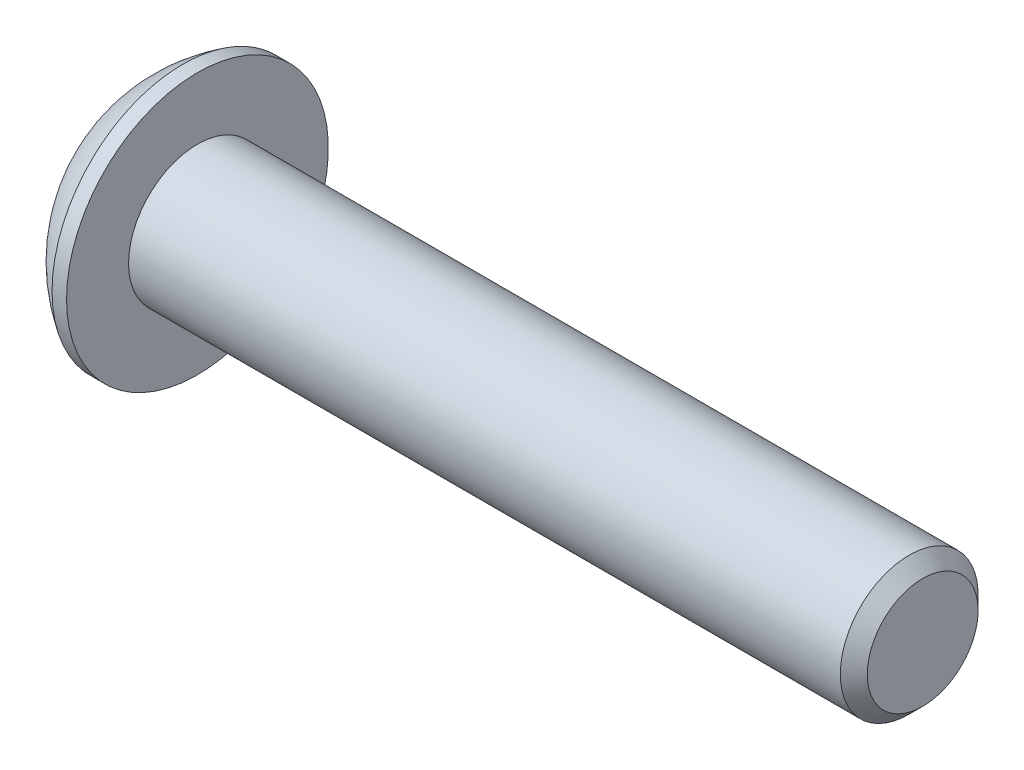
ISO-10303-21;
HEADER;
FILE_DESCRIPTION(('STEP AP214'),'2;1');
FILE_NAME('part.step','',(''),(''),'','','');
FILE_SCHEMA(('AUTOMOTIVE_DESIGN { 1 0 10303 214 1 1 1 1 }'));
ENDSEC;
DATA;
#1=APPLICATION_CONTEXT('core data for automotive mechanical design processes');
#2=APPLICATION_PROTOCOL_DEFINITION('international standard','automotive_design',2000,#1);
#3=PRODUCT_CONTEXT('',#1,'mechanical');
#4=PRODUCT('Part','Part','',(#3));
#5=PRODUCT_RELATED_PRODUCT_CATEGORY('part','',(#4));
#6=PRODUCT_DEFINITION_FORMATION('','',#4);
#7=PRODUCT_DEFINITION_CONTEXT('part definition',#1,'design');
#8=PRODUCT_DEFINITION('design','',#6,#7);
#9=PRODUCT_DEFINITION_SHAPE('','',#8);
#10=(LENGTH_UNIT() NAMED_UNIT(*) SI_UNIT(.MILLI.,.METRE.));
#11=(NAMED_UNIT(*) PLANE_ANGLE_UNIT() SI_UNIT($,.RADIAN.));
#12=(NAMED_UNIT(*) SI_UNIT($,.STERADIAN.) SOLID_ANGLE_UNIT());
#13=UNCERTAINTY_MEASURE_WITH_UNIT(LENGTH_MEASURE(1.E-05),#10,'distance_accuracy_value','');
#14=(GEOMETRIC_REPRESENTATION_CONTEXT(3) GLOBAL_UNCERTAINTY_ASSIGNED_CONTEXT((#13)) GLOBAL_UNIT_ASSIGNED_CONTEXT((#10,
#11,#12)) REPRESENTATION_CONTEXT('',''));
#15=CARTESIAN_POINT('',(0.,0.,0.));
#16=DIRECTION('',(0.,0.,1.));
#17=DIRECTION('',(1.,0.,0.));
#18=AXIS2_PLACEMENT_3D('',#15,#16,#17);
#19=CARTESIAN_POINT('',(1.77800000000006,0.,0.));
#20=DIRECTION('',(-1.,0.,0.));
#21=DIRECTION('',(0.,0.,1.));
#22=AXIS2_PLACEMENT_3D('',#19,#20,#21);
#23=CONICAL_SURFACE('',#22,1.58750000000007,1.04719755119647);
#24=CARTESIAN_POINT('',(2.69454355233878,0.,0.));
#25=VERTEX_POINT('',#24);
#26=VERTEX_LOOP('',#25);
#27=FACE_BOUND('',#26,.T.);
#28=CARTESIAN_POINT('',(1.77800000000006,0.,0.));
#29=DIRECTION('',(-1.,0.,0.));
#30=DIRECTION('',(0.,0.,1.));
#31=AXIS2_PLACEMENT_3D('',#28,#29,#30);
#32=CIRCLE('',#31,1.58750000000007);
#33=CARTESIAN_POINT('',(1.77800000000003,0.,1.58750000000004));
#34=VERTEX_POINT('',#33);
#35=CARTESIAN_POINT('',(1.77800000000003,-1.37481532850783,0.793750000000017));
#36=VERTEX_POINT('',#35);
#37=EDGE_CURVE('E20',#34,#36,#32,.F.);
#38=ORIENTED_EDGE('',*,*,#37,.F.);
#39=CARTESIAN_POINT('',(1.77800000000006,0.,0.));
#40=DIRECTION('',(-1.,0.,0.));
#41=DIRECTION('',(0.,0.,1.));
#42=AXIS2_PLACEMENT_3D('',#39,#40,#41);
#43=CIRCLE('',#42,1.58750000000007);
#44=CARTESIAN_POINT('',(1.77800000000003,1.37481532850783,0.793750000000019));
#45=VERTEX_POINT('',#44);
#46=EDGE_CURVE('E90',#34,#45,#43,.T.);
#47=ORIENTED_EDGE('',*,*,#46,.T.);
#48=CARTESIAN_POINT('',(1.77800000000006,0.,0.));
#49=DIRECTION('',(-1.,0.,0.));
#50=DIRECTION('',(0.,0.,1.));
#51=AXIS2_PLACEMENT_3D('',#48,#49,#50);
#52=CIRCLE('',#51,1.58750000000007);
#53=CARTESIAN_POINT('',(1.77800000000003,1.37481532850783,-0.793750000000019));
#54=VERTEX_POINT('',#53);
#55=EDGE_CURVE('E106',#45,#54,#52,.T.);
#56=ORIENTED_EDGE('',*,*,#55,.T.);
#57=CARTESIAN_POINT('',(1.77800000000006,0.,0.));
#58=DIRECTION('',(-1.,0.,0.));
#59=DIRECTION('',(0.,0.,1.));
#60=AXIS2_PLACEMENT_3D('',#57,#58,#59);
#61=CIRCLE('',#60,1.58750000000007);
#62=CARTESIAN_POINT('',(1.77800000000003,-2.78602967841758E-12,-1.58750000000004));
#63=VERTEX_POINT('',#62);
#64=EDGE_CURVE('E473',#54,#63,#61,.T.);
#65=ORIENTED_EDGE('',*,*,#64,.T.);
#66=CARTESIAN_POINT('',(1.77800000000006,0.,0.));
#67=DIRECTION('',(-1.,0.,0.));
#68=DIRECTION('',(0.,0.,1.));
#69=AXIS2_PLACEMENT_3D('',#66,#67,#68);
#70=CIRCLE('',#69,1.58750000000007);
#71=CARTESIAN_POINT('',(1.77800000000003,-1.37481532850783,-0.793750000000017));
#72=VERTEX_POINT('',#71);
#73=EDGE_CURVE('E475',#72,#63,#70,.F.);
#74=ORIENTED_EDGE('',*,*,#73,.F.);
#75=CARTESIAN_POINT('',(1.77800000000006,0.,0.));
#76=DIRECTION('',(-1.,0.,0.));
#77=DIRECTION('',(0.,0.,1.));
#78=AXIS2_PLACEMENT_3D('',#75,#76,#77);
#79=CIRCLE('',#78,1.58750000000007);
#80=EDGE_CURVE('E93',#36,#72,#79,.F.);
#81=ORIENTED_EDGE('',*,*,#80,.F.);
#82=EDGE_LOOP('',(#38,#47,#56,#65,#74,#81));
#83=FACE_BOUND('',#82,.T.);
#84=ADVANCED_FACE('F17',(#27,#83),#23,.F.);
#85=CARTESIAN_POINT('',(1.778,-2.74963065701559,-1.5875));
#86=DIRECTION('',(1.,0.,0.));
#87=DIRECTION('',(0.,0.,-1.));
#88=AXIS2_PLACEMENT_3D('',#85,#86,#87);
#89=PLANE('',#88);
#90=DIRECTION('',(0.,0.5,0.866025403784439));
#91=VECTOR('',#90,1.);
#92=CARTESIAN_POINT('',(1.778,-1.83308710467706,0.));
#93=LINE('',#92,#91);
#94=CARTESIAN_POINT('',(1.778,-0.91654355233853,1.5875));
#95=VERTEX_POINT('',#94);
#96=EDGE_CURVE('E111',#95,#36,#93,.F.);
#97=ORIENTED_EDGE('',*,*,#96,.F.);
#98=DIRECTION('',(0.,1.,0.));
#99=VECTOR('',#98,1.);
#100=CARTESIAN_POINT('',(1.778,-0.91654355233853,1.5875));
#101=LINE('',#100,#99);
#102=EDGE_CURVE('E109',#34,#95,#101,.F.);
#103=ORIENTED_EDGE('',*,*,#102,.F.);
#104=ORIENTED_EDGE('',*,*,#37,.T.);
#105=EDGE_LOOP('',(#97,#103,#104));
#106=FACE_BOUND('',#105,.T.);
#107=ADVANCED_FACE('F110',(#106),#89,.F.);
#108=CARTESIAN_POINT('',(1.778,-2.74963065701559,-1.5875));
#109=DIRECTION('',(1.,0.,0.));
#110=DIRECTION('',(0.,0.,-1.));
#111=AXIS2_PLACEMENT_3D('',#108,#109,#110);
#112=PLANE('',#111);
#113=DIRECTION('',(0.,-0.5,0.866025403784439));
#114=VECTOR('',#113,1.);
#115=CARTESIAN_POINT('',(1.778,-0.91654355233853,-1.5875));
#116=LINE('',#115,#114);
#117=CARTESIAN_POINT('',(1.778,-1.83308710467706,0.));
#118=VERTEX_POINT('',#117);
#119=EDGE_CURVE('E159',#118,#72,#116,.F.);
#120=ORIENTED_EDGE('',*,*,#119,.F.);
#121=DIRECTION('',(0.,0.5,0.866025403784439));
#122=VECTOR('',#121,1.);
#123=CARTESIAN_POINT('',(1.778,-1.83308710467706,0.));
#124=LINE('',#123,#122);
#125=EDGE_CURVE('E171',#36,#118,#124,.F.);
#126=ORIENTED_EDGE('',*,*,#125,.F.);
#127=ORIENTED_EDGE('',*,*,#80,.T.);
#128=EDGE_LOOP('',(#120,#126,#127));
#129=FACE_BOUND('',#128,.T.);
#130=ADVANCED_FACE('F248',(#129),#112,.F.);
#131=CARTESIAN_POINT('',(1.778,-2.74963065701559,-1.5875));
#132=DIRECTION('',(1.,0.,0.));
#133=DIRECTION('',(0.,0.,-1.));
#134=AXIS2_PLACEMENT_3D('',#131,#132,#133);
#135=PLANE('',#134);
#136=DIRECTION('',(0.,1.,0.));
#137=VECTOR('',#136,1.);
#138=CARTESIAN_POINT('',(1.778,0.916543552338532,-1.5875));
#139=LINE('',#138,#137);
#140=CARTESIAN_POINT('',(1.778,-0.91654355233853,-1.5875));
#141=VERTEX_POINT('',#140);
#142=EDGE_CURVE('E143',#141,#63,#139,.T.);
#143=ORIENTED_EDGE('',*,*,#142,.F.);
#144=DIRECTION('',(0.,-0.5,0.866025403784439));
#145=VECTOR('',#144,1.);
#146=CARTESIAN_POINT('',(1.778,-0.91654355233853,-1.5875));
#147=LINE('',#146,#145);
#148=EDGE_CURVE('E156',#72,#141,#147,.F.);
#149=ORIENTED_EDGE('',*,*,#148,.F.);
#150=ORIENTED_EDGE('',*,*,#73,.T.);
#151=EDGE_LOOP('',(#143,#149,#150));
#152=FACE_BOUND('',#151,.T.);
#153=ADVANCED_FACE('F244',(#152),#135,.F.);
#154=CARTESIAN_POINT('',(1.778,-2.74963065701559,-1.5875));
#155=DIRECTION('',(1.,0.,0.));
#156=DIRECTION('',(0.,0.,-1.));
#157=AXIS2_PLACEMENT_3D('',#154,#155,#156);
#158=PLANE('',#157);
#159=DIRECTION('',(0.,-0.5,-0.866025403784439));
#160=VECTOR('',#159,1.);
#161=CARTESIAN_POINT('',(1.778,1.83308710467706,0.));
#162=LINE('',#161,#160);
#163=CARTESIAN_POINT('',(1.778,0.916543552338532,-1.5875));
#164=VERTEX_POINT('',#163);
#165=EDGE_CURVE('E128',#164,#54,#162,.F.);
#166=ORIENTED_EDGE('',*,*,#165,.F.);
#167=DIRECTION('',(0.,1.,0.));
#168=VECTOR('',#167,1.);
#169=CARTESIAN_POINT('',(1.778,0.916543552338532,-1.5875));
#170=LINE('',#169,#168);
#171=EDGE_CURVE('E140',#63,#164,#170,.T.);
#172=ORIENTED_EDGE('',*,*,#171,.F.);
#173=ORIENTED_EDGE('',*,*,#64,.F.);
#174=EDGE_LOOP('',(#166,#172,#173));
#175=FACE_BOUND('',#174,.T.);
#176=ADVANCED_FACE('F240',(#175),#158,.F.);
#177=CARTESIAN_POINT('',(1.778,-2.74963065701559,-1.5875));
#178=DIRECTION('',(1.,0.,0.));
#179=DIRECTION('',(0.,0.,-1.));
#180=AXIS2_PLACEMENT_3D('',#177,#178,#179);
#181=PLANE('',#180);
#182=DIRECTION('',(0.,0.5,-0.866025403784439));
#183=VECTOR('',#182,1.);
#184=CARTESIAN_POINT('',(1.778,0.916543552338533,1.5875));
#185=LINE('',#184,#183);
#186=CARTESIAN_POINT('',(1.778,1.83308710467706,0.));
#187=VERTEX_POINT('',#186);
#188=EDGE_CURVE('E148',#187,#45,#185,.F.);
#189=ORIENTED_EDGE('',*,*,#188,.F.);
#190=DIRECTION('',(0.,-0.5,-0.866025403784439));
#191=VECTOR('',#190,1.);
#192=CARTESIAN_POINT('',(1.778,1.83308710467706,0.));
#193=LINE('',#192,#191);
#194=EDGE_CURVE('E125',#54,#187,#193,.F.);
#195=ORIENTED_EDGE('',*,*,#194,.F.);
#196=ORIENTED_EDGE('',*,*,#55,.F.);
#197=EDGE_LOOP('',(#189,#195,#196));
#198=FACE_BOUND('',#197,.T.);
#199=ADVANCED_FACE('F237',(#198),#181,.F.);
#200=CARTESIAN_POINT('',(1.778,-2.74963065701559,-1.5875));
#201=DIRECTION('',(1.,0.,0.));
#202=DIRECTION('',(0.,0.,-1.));
#203=AXIS2_PLACEMENT_3D('',#200,#201,#202);
#204=PLANE('',#203);
#205=DIRECTION('',(0.,1.,0.));
#206=VECTOR('',#205,1.);
#207=CARTESIAN_POINT('',(1.778,-0.91654355233853,1.5875));
#208=LINE('',#207,#206);
#209=CARTESIAN_POINT('',(1.778,0.916543552338533,1.5875));
#210=VERTEX_POINT('',#209);
#211=EDGE_CURVE('E101',#210,#34,#208,.F.);
#212=ORIENTED_EDGE('',*,*,#211,.F.);
#213=DIRECTION('',(0.,0.5,-0.866025403784439));
#214=VECTOR('',#213,1.);
#215=CARTESIAN_POINT('',(1.778,0.916543552338533,1.5875));
#216=LINE('',#215,#214);
#217=EDGE_CURVE('E104',#45,#210,#216,.F.);
#218=ORIENTED_EDGE('',*,*,#217,.F.);
#219=ORIENTED_EDGE('',*,*,#46,.F.);
#220=EDGE_LOOP('',(#212,#218,#219));
#221=FACE_BOUND('',#220,.T.);
#222=ADVANCED_FACE('F99',(#221),#204,.F.);
#223=CARTESIAN_POINT('',(1.778,-0.91654355233853,1.5875));
#224=DIRECTION('',(0.,0.,-1.));
#225=DIRECTION('',(0.,1.,0.));
#226=AXIS2_PLACEMENT_3D('',#223,#224,#225);
#227=PLANE('',#226);
#228=DIRECTION('',(0.,1.,0.));
#229=VECTOR('',#228,1.);
#230=CARTESIAN_POINT('',(0.,0.,1.5875));
#231=LINE('',#230,#229);
#232=CARTESIAN_POINT('',(0.,0.916543552338532,1.5875));
#233=VERTEX_POINT('',#232);
#234=CARTESIAN_POINT('',(0.,-0.91654355233853,1.5875));
#235=VERTEX_POINT('',#234);
#236=EDGE_CURVE('E132',#233,#235,#231,.F.);
#237=ORIENTED_EDGE('',*,*,#236,.F.);
#238=DIRECTION('',(1.,0.,0.));
#239=VECTOR('',#238,1.);
#240=CARTESIAN_POINT('',(1.778,0.916543552338533,1.5875));
#241=LINE('',#240,#239);
#242=EDGE_CURVE('E117',#210,#233,#241,.F.);
#243=ORIENTED_EDGE('',*,*,#242,.F.);
#244=ORIENTED_EDGE('',*,*,#211,.T.);
#245=ORIENTED_EDGE('',*,*,#102,.T.);
#246=DIRECTION('',(1.,0.,0.));
#247=VECTOR('',#246,1.);
#248=CARTESIAN_POINT('',(1.778,-0.91654355233853,1.5875));
#249=LINE('',#248,#247);
#250=EDGE_CURVE('E168',#235,#95,#249,.T.);
#251=ORIENTED_EDGE('',*,*,#250,.F.);
#252=EDGE_LOOP('',(#237,#243,#244,#245,#251));
#253=FACE_BOUND('',#252,.T.);
#254=ADVANCED_FACE('F115',(#253),#227,.T.);
#255=CARTESIAN_POINT('',(1.778,-1.83308710467706,0.));
#256=DIRECTION('',(0.,0.866025403784439,-0.5));
#257=DIRECTION('',(0.,0.5,0.866025403784439));
#258=AXIS2_PLACEMENT_3D('',#255,#256,#257);
#259=PLANE('',#258);
#260=DIRECTION('',(0.,-0.5,-0.866025403784439));
#261=VECTOR('',#260,1.);
#262=CARTESIAN_POINT('',(0.,-0.91654355233853,1.5875));
#263=LINE('',#262,#261);
#264=CARTESIAN_POINT('',(0.,-1.83308710467706,0.));
#265=VERTEX_POINT('',#264);
#266=EDGE_CURVE('E459',#235,#265,#263,.T.);
#267=ORIENTED_EDGE('',*,*,#266,.F.);
#268=ORIENTED_EDGE('',*,*,#250,.T.);
#269=ORIENTED_EDGE('',*,*,#96,.T.);
#270=ORIENTED_EDGE('',*,*,#125,.T.);
#271=DIRECTION('',(1.,0.,0.));
#272=VECTOR('',#271,1.);
#273=CARTESIAN_POINT('',(1.778,-1.83308710467706,0.));
#274=LINE('',#273,#272);
#275=EDGE_CURVE('E153',#265,#118,#274,.T.);
#276=ORIENTED_EDGE('',*,*,#275,.F.);
#277=EDGE_LOOP('',(#267,#268,#269,#270,#276));
#278=FACE_BOUND('',#277,.T.);
#279=ADVANCED_FACE('F228',(#278),#259,.T.);
#280=CARTESIAN_POINT('',(1.778,-0.91654355233853,-1.5875));
#281=DIRECTION('',(0.,0.866025403784439,0.5));
#282=DIRECTION('',(0.,-0.5,0.866025403784439));
#283=AXIS2_PLACEMENT_3D('',#280,#281,#282);
#284=PLANE('',#283);
#285=DIRECTION('',(0.,0.5,-0.866025403784439));
#286=VECTOR('',#285,1.);
#287=CARTESIAN_POINT('',(0.,-1.83308710467706,0.));
#288=LINE('',#287,#286);
#289=CARTESIAN_POINT('',(0.,-0.91654355233853,-1.5875));
#290=VERTEX_POINT('',#289);
#291=EDGE_CURVE('E456',#265,#290,#288,.T.);
#292=ORIENTED_EDGE('',*,*,#291,.F.);
#293=ORIENTED_EDGE('',*,*,#275,.T.);
#294=ORIENTED_EDGE('',*,*,#119,.T.);
#295=ORIENTED_EDGE('',*,*,#148,.T.);
#296=DIRECTION('',(1.,0.,0.));
#297=VECTOR('',#296,1.);
#298=CARTESIAN_POINT('',(1.778,-0.91654355233853,-1.5875));
#299=LINE('',#298,#297);
#300=EDGE_CURVE('E137',#290,#141,#299,.T.);
#301=ORIENTED_EDGE('',*,*,#300,.F.);
#302=EDGE_LOOP('',(#292,#293,#294,#295,#301));
#303=FACE_BOUND('',#302,.T.);
#304=ADVANCED_FACE('F224',(#303),#284,.T.);
#305=CARTESIAN_POINT('',(1.778,0.916543552338532,-1.5875));
#306=DIRECTION('',(0.,0.,1.));
#307=DIRECTION('',(1.,0.,0.));
#308=AXIS2_PLACEMENT_3D('',#305,#306,#307);
#309=PLANE('',#308);
#310=DIRECTION('',(0.,1.,0.));
#311=VECTOR('',#310,1.);
#312=CARTESIAN_POINT('',(0.,0.,-1.5875));
#313=LINE('',#312,#311);
#314=CARTESIAN_POINT('',(0.,0.916543552338532,-1.5875));
#315=VERTEX_POINT('',#314);
#316=EDGE_CURVE('E453',#290,#315,#313,.T.);
#317=ORIENTED_EDGE('',*,*,#316,.F.);
#318=ORIENTED_EDGE('',*,*,#300,.T.);
#319=ORIENTED_EDGE('',*,*,#142,.T.);
#320=ORIENTED_EDGE('',*,*,#171,.T.);
#321=DIRECTION('',(1.,0.,0.));
#322=VECTOR('',#321,1.);
#323=CARTESIAN_POINT('',(1.778,0.916543552338532,-1.5875));
#324=LINE('',#323,#322);
#325=EDGE_CURVE('E127',#315,#164,#324,.T.);
#326=ORIENTED_EDGE('',*,*,#325,.F.);
#327=EDGE_LOOP('',(#317,#318,#319,#320,#326));
#328=FACE_BOUND('',#327,.T.);
#329=ADVANCED_FACE('F221',(#328),#309,.T.);
#330=CARTESIAN_POINT('',(1.778,1.83308710467706,0.));
#331=DIRECTION('',(0.,-0.866025403784439,0.5));
#332=DIRECTION('',(0.,-0.5,-0.866025403784439));
#333=AXIS2_PLACEMENT_3D('',#330,#331,#332);
#334=PLANE('',#333);
#335=DIRECTION('',(0.,0.5,0.866025403784438));
#336=VECTOR('',#335,1.);
#337=CARTESIAN_POINT('',(0.,0.916543552338532,-1.5875));
#338=LINE('',#337,#336);
#339=CARTESIAN_POINT('',(0.,1.83308710467706,0.));
#340=VERTEX_POINT('',#339);
#341=EDGE_CURVE('E450',#315,#340,#338,.T.);
#342=ORIENTED_EDGE('',*,*,#341,.F.);
#343=ORIENTED_EDGE('',*,*,#325,.T.);
#344=ORIENTED_EDGE('',*,*,#165,.T.);
#345=ORIENTED_EDGE('',*,*,#194,.T.);
#346=DIRECTION('',(1.,0.,0.));
#347=VECTOR('',#346,1.);
#348=CARTESIAN_POINT('',(1.778,1.83308710467706,0.));
#349=LINE('',#348,#347);
#350=EDGE_CURVE('E35',#340,#187,#349,.T.);
#351=ORIENTED_EDGE('',*,*,#350,.F.);
#352=EDGE_LOOP('',(#342,#343,#344,#345,#351));
#353=FACE_BOUND('',#352,.T.);
#354=ADVANCED_FACE('F217',(#353),#334,.T.);
#355=CARTESIAN_POINT('',(1.778,0.916543552338533,1.5875));
#356=DIRECTION('',(0.,-0.866025403784439,-0.5));
#357=DIRECTION('',(0.,0.5,-0.866025403784439));
#358=AXIS2_PLACEMENT_3D('',#355,#356,#357);
#359=PLANE('',#358);
#360=DIRECTION('',(0.,-0.5,0.866025403784439));
#361=VECTOR('',#360,1.);
#362=CARTESIAN_POINT('',(0.,1.83308710467706,0.));
#363=LINE('',#362,#361);
#364=EDGE_CURVE('E203',#340,#233,#363,.T.);
#365=ORIENTED_EDGE('',*,*,#364,.F.);
#366=ORIENTED_EDGE('',*,*,#350,.T.);
#367=ORIENTED_EDGE('',*,*,#188,.T.);
#368=ORIENTED_EDGE('',*,*,#217,.T.);
#369=ORIENTED_EDGE('',*,*,#242,.T.);
#370=EDGE_LOOP('',(#365,#366,#367,#368,#369));
#371=FACE_BOUND('',#370,.T.);
#372=ADVANCED_FACE('F213',(#371),#359,.T.);
#373=CARTESIAN_POINT('',(0.,0.,0.));
#374=DIRECTION('',(-1.,0.,0.));
#375=DIRECTION('',(0.,0.,1.));
#376=AXIS2_PLACEMENT_3D('',#373,#374,#375);
#377=PLANE('',#376);
#378=ORIENTED_EDGE('',*,*,#341,.T.);
#379=ORIENTED_EDGE('',*,*,#364,.T.);
#380=ORIENTED_EDGE('',*,*,#236,.T.);
#381=ORIENTED_EDGE('',*,*,#266,.T.);
#382=ORIENTED_EDGE('',*,*,#291,.T.);
#383=ORIENTED_EDGE('',*,*,#316,.T.);
#384=EDGE_LOOP('',(#378,#379,#380,#381,#382,#383));
#385=FACE_BOUND('',#384,.T.);
#386=CARTESIAN_POINT('',(0.,2.29235,0.));
#387=CARTESIAN_POINT('',(0.,2.29234961429956,0.0643619991867155));
#388=CARTESIAN_POINT('',(0.,2.28963695190107,0.128735826629365));
#389=CARTESIAN_POINT('',(0.,2.27880393843647,0.257038618985286));
#390=CARTESIAN_POINT('',(0.,2.27068199085126,0.320967446929162));
#391=CARTESIAN_POINT('',(0.,2.24906694794255,0.448021254607717));
#392=CARTESIAN_POINT('',(-2.10840056970795E-13,2.2355653265346,0.51114479338186));
#393=CARTESIAN_POINT('',(2.11879226109671E-13,2.20328400495644,0.636065176149321));
#394=CARTESIAN_POINT('',(7.89917625163527E-13,2.18450002159113,0.697860899533934));
#395=CARTESIAN_POINT('',(1.31285126424162E-12,2.12048422735802,0.880329802927747));
#396=CARTESIAN_POINT('',(0.,2.06753599079459,0.998391795928116));
#397=CARTESIAN_POINT('',(0.,1.94254204858672,1.22393765942147));
#398=CARTESIAN_POINT('',(1.0943500696831E-12,1.87049561696642,1.33142112758208));
#399=CARTESIAN_POINT('',(6.78225420709987E-13,1.7497425419488,1.48237719670935));
#400=CARTESIAN_POINT('',(1.81996039545648E-13,1.707345731323,1.53101280076737));
#401=CARTESIAN_POINT('',(-1.80953624347813E-13,1.61863910291529,1.62450601319185));
#402=CARTESIAN_POINT('',(0.,1.57233309727312,1.66936721890417));
#403=CARTESIAN_POINT('',(0.,1.47608431707233,1.7550488420402));
#404=CARTESIAN_POINT('',(0.,1.42613990458994,1.79586741981512));
#405=CARTESIAN_POINT('',(0.,1.3229945254125,1.87315615311522));
#406=CARTESIAN_POINT('',(0.,1.26979280714187,1.90962529930697));
#407=CARTESIAN_POINT('',(0.,1.10588180153952,2.01207722151089));
#408=CARTESIAN_POINT('',(0.,0.990764947001307,2.07119486286666));
#409=CARTESIAN_POINT('',(0.,0.752302198839713,2.16922858468856));
#410=CARTESIAN_POINT('',(0.,0.628956393121256,2.20814488091449));
#411=CARTESIAN_POINT('',(0.,0.377466101733266,2.2647275576592));
#412=CARTESIAN_POINT('',(0.,0.249321590440377,2.28239382469379));
#413=CARTESIAN_POINT('',(0.,-0.00811435371610997,2.29595665980955));
#414=CARTESIAN_POINT('',(0.,-0.137405786579708,2.29185322789072));
#415=CARTESIAN_POINT('',(0.,-0.393449386933728,2.2620096240906));
#416=CARTESIAN_POINT('',(0.,-0.520201567981086,2.23626956775766));
#417=CARTESIAN_POINT('',(0.,-0.767645294384453,2.16383549332687));
#418=CARTESIAN_POINT('',(0.,-0.888336774993558,2.11714125142685));
#419=CARTESIAN_POINT('',(0.,-1.06210572146656,2.03247976453654));
#420=CARTESIAN_POINT('',(0.,-1.11884498714067,2.00180278323695));
#421=CARTESIAN_POINT('',(0.,-1.22954062855573,1.93578011658036));
#422=CARTESIAN_POINT('',(0.,-1.28349764565393,1.9004355139425));
#423=CARTESIAN_POINT('',(0.,-1.38821676641538,1.82534174602347));
#424=CARTESIAN_POINT('',(0.,-1.43898030563029,1.78559458231503));
#425=CARTESIAN_POINT('',(0.,-1.53701984534432,1.70193996292361));
#426=CARTESIAN_POINT('',(0.,-1.58429243280551,1.65802852924127));
#427=CARTESIAN_POINT('',(0.,-1.72023903553759,1.52059650554139));
#428=CARTESIAN_POINT('',(0.,-1.80318066138239,1.42127847626519));
#429=CARTESIAN_POINT('',(0.,-1.95118232345099,1.21011519784664));
#430=CARTESIAN_POINT('',(0.,-2.01624303935585,1.09827042509272));
#431=CARTESIAN_POINT('',(0.,-2.09907772661315,0.923538238005837));
#432=CARTESIAN_POINT('',(0.,-2.12425103063559,0.864058373981965));
#433=CARTESIAN_POINT('',(0.,-2.16947990046566,0.7432215621756));
#434=CARTESIAN_POINT('',(0.,-2.18953960800685,0.681866178863365));
#435=CARTESIAN_POINT('',(0.,-2.22438542051157,0.557786972400357));
#436=CARTESIAN_POINT('',(0.,-2.23917985294819,0.495065478128173));
#437=CARTESIAN_POINT('',(0.,-2.26343456384454,0.368611258323516));
#438=CARTESIAN_POINT('',(0.,-2.27289641559286,0.30487883675957));
#439=CARTESIAN_POINT('',(0.,-2.28388649696737,0.200873029360625));
#440=CARTESIAN_POINT('',(0.,-2.28705930623294,0.160766164180098));
#441=CARTESIAN_POINT('',(0.,-2.29129117827045,0.0804410725432715));
#442=CARTESIAN_POINT('',(0.,-2.29235024104239,0.0402228460869717));
#443=CARTESIAN_POINT('',(0.,-2.29234961429957,-0.0643619991867168));
#444=CARTESIAN_POINT('',(0.,-2.28963695190109,-0.128735826629366));
#445=CARTESIAN_POINT('',(0.,-2.27880393843648,-0.257038618985287));
#446=CARTESIAN_POINT('',(0.,-2.27068199085127,-0.320967446929163));
#447=CARTESIAN_POINT('',(0.,-2.24906694794256,-0.448021254607718));
#448=CARTESIAN_POINT('',(-2.11158505516439E-13,-2.23556532653461,-0.511144793381861));
#449=CARTESIAN_POINT('',(2.12197933617066E-13,-2.20328400495644,-0.636065176149321));
#450=CARTESIAN_POINT('',(7.91271169771705E-13,-2.18450002159114,-0.697860899533935));
#451=CARTESIAN_POINT('',(1.31534652841856E-12,-2.12048422735803,-0.880329802927748));
#452=CARTESIAN_POINT('',(0.,-2.06753599079459,-0.998391795928114));
#453=CARTESIAN_POINT('',(0.,-1.94254204858673,-1.22393765942147));
#454=CARTESIAN_POINT('',(1.09423089153949E-12,-1.87049561696643,-1.33142112758208));
#455=CARTESIAN_POINT('',(6.78285087865736E-13,-1.74974254194881,-1.48237719670935));
#456=CARTESIAN_POINT('',(1.82011279261461E-13,-1.70734573132301,-1.53101280076737));
#457=CARTESIAN_POINT('',(-1.80968849370244E-13,-1.61863910291529,-1.62450601319185));
#458=CARTESIAN_POINT('',(0.,-1.57233309727313,-1.66936721890417));
#459=CARTESIAN_POINT('',(0.,-1.47608431707234,-1.7550488420402));
#460=CARTESIAN_POINT('',(0.,-1.42613990458995,-1.79586741981512));
#461=CARTESIAN_POINT('',(0.,-1.32299452541251,-1.87315615311522));
#462=CARTESIAN_POINT('',(0.,-1.26979280714188,-1.90962529930696));
#463=CARTESIAN_POINT('',(0.,-1.10588180153952,-2.01207722151089));
#464=CARTESIAN_POINT('',(0.,-0.990764947001314,-2.07119486286666));
#465=CARTESIAN_POINT('',(0.,-0.752302198839721,-2.16922858468856));
#466=CARTESIAN_POINT('',(0.,-0.628956393121265,-2.2081448809145));
#467=CARTESIAN_POINT('',(0.,-0.377466101733274,-2.2647275576592));
#468=CARTESIAN_POINT('',(0.,-0.249321590440385,-2.28239382469379));
#469=CARTESIAN_POINT('',(0.,0.0081143537161019,-2.29595665980955));
#470=CARTESIAN_POINT('',(0.,0.1374057865797,-2.29185322789072));
#471=CARTESIAN_POINT('',(0.,0.39344938693372,-2.2620096240906));
#472=CARTESIAN_POINT('',(0.,0.520201567981077,-2.23626956775766));
#473=CARTESIAN_POINT('',(0.,0.767645294384445,-2.16383549332687));
#474=CARTESIAN_POINT('',(0.,0.88833677499355,-2.11714125142685));
#475=CARTESIAN_POINT('',(0.,1.06210572146656,-2.03247976453654));
#476=CARTESIAN_POINT('',(0.,1.11884498714066,-2.00180278323695));
#477=CARTESIAN_POINT('',(0.,1.22954062855572,-1.93578011658036));
#478=CARTESIAN_POINT('',(0.,1.28349764565392,-1.9004355139425));
#479=CARTESIAN_POINT('',(0.,1.38821676641537,-1.82534174602348));
#480=CARTESIAN_POINT('',(0.,1.43898030563028,-1.78559458231503));
#481=CARTESIAN_POINT('',(0.,1.53701984534431,-1.70193996292361));
#482=CARTESIAN_POINT('',(0.,1.5842924328055,-1.65802852924127));
#483=CARTESIAN_POINT('',(0.,1.72023903553758,-1.52059650554139));
#484=CARTESIAN_POINT('',(0.,1.80318066138238,-1.42127847626519));
#485=CARTESIAN_POINT('',(0.,1.95118232345098,-1.21011519784664));
#486=CARTESIAN_POINT('',(0.,2.01624303935584,-1.09827042509272));
#487=CARTESIAN_POINT('',(0.,2.09907772661315,-0.923538238005838));
#488=CARTESIAN_POINT('',(0.,2.12425103063558,-0.864058373981966));
#489=CARTESIAN_POINT('',(0.,2.16947990046565,-0.7432215621756));
#490=CARTESIAN_POINT('',(0.,2.18953960800684,-0.681866178863365));
#491=CARTESIAN_POINT('',(0.,2.22438542051156,-0.557786972400357));
#492=CARTESIAN_POINT('',(0.,2.23917985294818,-0.495065478128172));
#493=CARTESIAN_POINT('',(0.,2.26343456384453,-0.368611258323515));
#494=CARTESIAN_POINT('',(0.,2.27289641559286,-0.304878836759569));
#495=CARTESIAN_POINT('',(0.,2.28388649696736,-0.200873029360625));
#496=CARTESIAN_POINT('',(0.,2.28705930623293,-0.160766164180098));
#497=CARTESIAN_POINT('',(0.,2.29129117827044,-0.0804410725432719));
#498=CARTESIAN_POINT('',(0.,2.29235024104238,-0.0402228460869725));
#499=CARTESIAN_POINT('',(0.,2.29235,0.));
#500=B_SPLINE_CURVE_WITH_KNOTS('',3,(#386,#387,#388,#389,#390,#391,#392,#393,#394,#395,#396,
#397,#398,#399,#400,#401,#402,#403,#404,#405,#406,#407,#408,#409,#410,#411,#412,#413,#414,#415,
#416,#417,#418,#419,#420,#421,#422,#423,#424,#425,#426,#427,#428,#429,#430,#431,#432,#433,#434,
#435,#436,#437,#438,#439,#440,#441,#442,#443,#444,#445,#446,#447,#448,#449,#450,#451,#452,#453,
#454,#455,#456,#457,#458,#459,#460,#461,#462,#463,#464,#465,#466,#467,#468,#469,#470,#471,#472,
#473,#474,#475,#476,#477,#478,#479,#480,#481,#482,#483,#484,#485,#486,#487,#488,#489,#490,#491,
#492,#493,#494,#495,#496,#497,#498,#499),.UNSPECIFIED.,.T.,.F.,(4,2,2,2,2,2,2,2,2,2,2,2,2,2,2,2,
2,2,2,2,2,2,2,2,2,2,2,2,2,2,2,2,2,2,2,2,2,2,2,2,2,2,2,2,2,2,2,2,2,2,2,2,2,2,2,2,4),(0.,
0.193048968618033,0.386154939782395,0.579568183995958,0.773138711491038,1.15935703864577,
1.54559004914645,1.73895960916368,1.93214273180063,2.12541336477221,2.31872876140888,
2.70495649282618,3.09118009906583,3.47740576789431,3.86363143672285,4.24985504296253,
4.63608277437979,4.82939817101619,5.02266880398748,5.2158519266242,5.40922148664122,
5.79545449714217,6.18167282429724,6.37524335179261,6.56865659600641,6.76176256717089,
6.95481153578908,7.07545693291922,7.19610233004937,7.3891512986674,7.58225726983176,
7.77567051404533,7.96924104154041,8.35545936869514,8.74169237919581,8.93506193921305,
9.12824506185,9.32151569482158,9.51483109145825,9.90105882287555,10.2872824291152,
10.6735080979437,11.0597337667722,11.4459573730119,11.8321851044292,12.0255005010656,
12.2187711340368,12.4119542566736,12.6053238166906,12.9915568271915,13.3777751543466,
13.571345681842,13.7647589260558,13.9578648972203,14.1509138658384,14.2715592629686,
14.3922046600987),.UNSPECIFIED.);
#501=CARTESIAN_POINT('',(0.,2.29235,0.));
#502=VERTEX_POINT('',#501);
#503=EDGE_CURVE('E197',#502,#502,#500,.T.);
#504=ORIENTED_EDGE('',*,*,#503,.F.);
#505=EDGE_LOOP('',(#504));
#506=FACE_BOUND('',#505,.T.);
#507=ADVANCED_FACE('F209',(#385,#506),#377,.T.);
#508=CARTESIAN_POINT('',(4.85989606481482,0.,0.));
#509=DIRECTION('',(0.,1.,0.));
#510=DIRECTION('',(1.,0.,0.));
#511=AXIS2_PLACEMENT_3D('',#508,#509,#510);
#512=SPHERICAL_SURFACE('',#511,5.37340285883187);
#513=CARTESIAN_POINT('',(2.0574,0.,0.));
#514=DIRECTION('',(-1.,0.,0.));
#515=DIRECTION('',(0.,0.,1.));
#516=AXIS2_PLACEMENT_3D('',#513,#514,#515);
#517=CIRCLE('',#516,4.5847);
#518=CARTESIAN_POINT('',(2.0574,0.,4.5847));
#519=VERTEX_POINT('',#518);
#520=EDGE_CURVE('E194',#519,#519,#517,.F.);
#521=ORIENTED_EDGE('',*,*,#520,.F.);
#522=EDGE_LOOP('',(#521));
#523=FACE_BOUND('',#522,.T.);
#524=ORIENTED_EDGE('',*,*,#503,.T.);
#525=EDGE_LOOP('',(#524));
#526=FACE_BOUND('',#525,.T.);
#527=ADVANCED_FACE('F205',(#523,#526),#512,.T.);
#528=CARTESIAN_POINT('',(27.9654,0.,0.));
#529=DIRECTION('',(-1.,0.,0.));
#530=DIRECTION('',(0.,0.,1.));
#531=AXIS2_PLACEMENT_3D('',#528,#529,#530);
#532=PLANE('',#531);
#533=CARTESIAN_POINT('',(27.9653999999709,0.,0.));
#534=DIRECTION('',(-1.,0.,0.));
#535=DIRECTION('',(0.,0.,1.));
#536=AXIS2_PLACEMENT_3D('',#533,#534,#535);
#537=CIRCLE('',#536,1.94056000003684);
#538=CARTESIAN_POINT('',(27.9653999999709,0.,1.94056000003684));
#539=VERTEX_POINT('',#538);
#540=EDGE_CURVE('E191',#539,#539,#537,.T.);
#541=ORIENTED_EDGE('',*,*,#540,.F.);
#542=EDGE_LOOP('',(#541));
#543=FACE_BOUND('',#542,.T.);
#544=ADVANCED_FACE('F276',(#543),#532,.F.);
#545=CARTESIAN_POINT('',(0.,0.,0.));
#546=DIRECTION('',(-1.,0.,0.));
#547=DIRECTION('',(0.,0.,1.));
#548=AXIS2_PLACEMENT_3D('',#545,#546,#547);
#549=CYLINDRICAL_SURFACE('',#548,4.5847);
#550=ORIENTED_EDGE('',*,*,#520,.T.);
#551=EDGE_LOOP('',(#550));
#552=FACE_BOUND('',#551,.T.);
#553=CARTESIAN_POINT('',(2.5654,0.,0.));
#554=DIRECTION('',(-1.,0.,0.));
#555=DIRECTION('',(0.,0.,1.));
#556=AXIS2_PLACEMENT_3D('',#553,#554,#555);
#557=CIRCLE('',#556,4.5847);
#558=CARTESIAN_POINT('',(2.5654,0.,4.5847));
#559=VERTEX_POINT('',#558);
#560=EDGE_CURVE('E188',#559,#559,#557,.T.);
#561=ORIENTED_EDGE('',*,*,#560,.T.);
#562=EDGE_LOOP('',(#561));
#563=FACE_BOUND('',#562,.T.);
#564=ADVANCED_FACE('F273',(#552,#563),#549,.T.);
#565=CARTESIAN_POINT('',(27.4929600000178,0.,0.));
#566=DIRECTION('',(-1.,0.,0.));
#567=DIRECTION('',(0.,0.,1.));
#568=AXIS2_PLACEMENT_3D('',#565,#566,#567);
#569=CONICAL_SURFACE('',#568,2.41299999999001,0.785398163397448);
#570=CARTESIAN_POINT('',(27.49296,0.,0.));
#571=DIRECTION('',(-1.,0.,0.));
#572=DIRECTION('',(0.,0.,1.));
#573=AXIS2_PLACEMENT_3D('',#570,#571,#572);
#574=CIRCLE('',#573,2.413);
#575=CARTESIAN_POINT('',(27.49296,0.,2.413));
#576=VERTEX_POINT('',#575);
#577=EDGE_CURVE('E26',#576,#576,#574,.T.);
#578=ORIENTED_EDGE('',*,*,#577,.F.);
#579=EDGE_LOOP('',(#578));
#580=FACE_BOUND('',#579,.T.);
#581=ORIENTED_EDGE('',*,*,#540,.T.);
#582=EDGE_LOOP('',(#581));
#583=FACE_BOUND('',#582,.T.);
#584=ADVANCED_FACE('F266',(#580,#583),#569,.T.);
#585=CARTESIAN_POINT('',(2.5654,2.41299999999999,0.));
#586=DIRECTION('',(-1.,0.,0.));
#587=DIRECTION('',(0.,0.,1.));
#588=AXIS2_PLACEMENT_3D('',#585,#586,#587);
#589=PLANE('',#588);
#590=CARTESIAN_POINT('',(2.5654,0.,0.));
#591=DIRECTION('',(-1.,0.,0.));
#592=DIRECTION('',(0.,0.,1.));
#593=AXIS2_PLACEMENT_3D('',#590,#591,#592);
#594=CIRCLE('',#593,2.413);
#595=CARTESIAN_POINT('',(2.5654,0.,2.413));
#596=VERTEX_POINT('',#595);
#597=EDGE_CURVE('E11',#596,#596,#594,.F.);
#598=ORIENTED_EDGE('',*,*,#597,.F.);
#599=EDGE_LOOP('',(#598));
#600=FACE_BOUND('',#599,.T.);
#601=ORIENTED_EDGE('',*,*,#560,.F.);
#602=EDGE_LOOP('',(#601));
#603=FACE_BOUND('',#602,.T.);
#604=ADVANCED_FACE('F260',(#600,#603),#589,.F.);
#605=CARTESIAN_POINT('',(0.,0.,0.));
#606=DIRECTION('',(-1.,0.,0.));
#607=DIRECTION('',(0.,0.,1.));
#608=AXIS2_PLACEMENT_3D('',#605,#606,#607);
#609=CYLINDRICAL_SURFACE('',#608,2.413);
#610=ORIENTED_EDGE('',*,*,#597,.T.);
#611=EDGE_LOOP('',(#610));
#612=FACE_BOUND('',#611,.T.);
#613=ORIENTED_EDGE('',*,*,#577,.T.);
#614=EDGE_LOOP('',(#613));
#615=FACE_BOUND('',#614,.T.);
#616=ADVANCED_FACE('F258',(#612,#615),#609,.T.);
#617=CLOSED_SHELL('',(#84,#107,#130,#153,#176,#199,#222,#254,#279,#304,#329,#354,#372,#507,#527,
#544,#564,#584,#604,#616));
#618=MANIFOLD_SOLID_BREP('B1',#617);
#619=ADVANCED_BREP_SHAPE_REPRESENTATION('',(#18,#618),#14);
#620=SHAPE_DEFINITION_REPRESENTATION(#9,#619);
ENDSEC;
END-ISO-10303-21;
